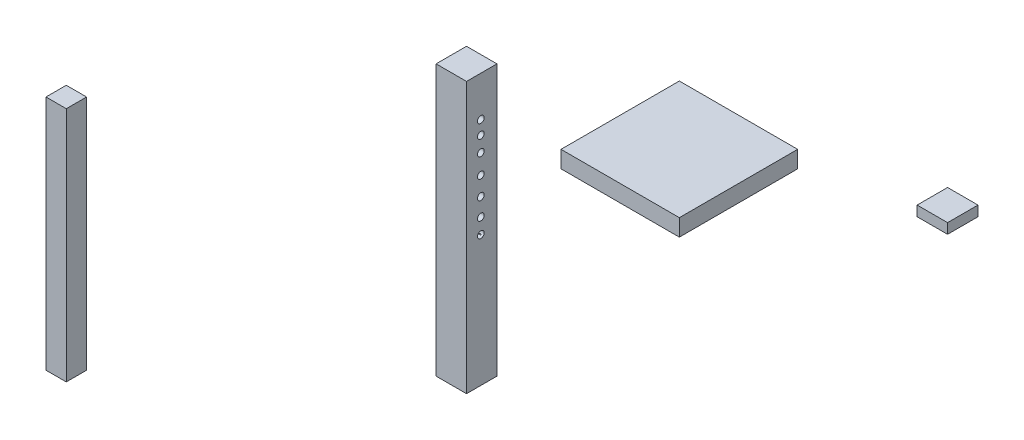
ISO-10303-21;
HEADER;
FILE_DESCRIPTION(('STEP AP214'),'2;1');
FILE_NAME('part.step','',(''),(''),'','','');
FILE_SCHEMA(('AUTOMOTIVE_DESIGN { 1 0 10303 214 1 1 1 1 }'));
ENDSEC;
DATA;
#1=APPLICATION_CONTEXT('core data for automotive mechanical design processes');
#2=APPLICATION_PROTOCOL_DEFINITION('international standard','automotive_design',2000,#1);
#3=PRODUCT_CONTEXT('',#1,'mechanical');
#4=PRODUCT('Part','Part','',(#3));
#5=PRODUCT_RELATED_PRODUCT_CATEGORY('part','',(#4));
#6=PRODUCT_DEFINITION_FORMATION('','',#4);
#7=PRODUCT_DEFINITION_CONTEXT('part definition',#1,'design');
#8=PRODUCT_DEFINITION('design','',#6,#7);
#9=PRODUCT_DEFINITION_SHAPE('','',#8);
#10=(LENGTH_UNIT() NAMED_UNIT(*) SI_UNIT(.MILLI.,.METRE.));
#11=(NAMED_UNIT(*) PLANE_ANGLE_UNIT() SI_UNIT($,.RADIAN.));
#12=(NAMED_UNIT(*) SI_UNIT($,.STERADIAN.) SOLID_ANGLE_UNIT());
#13=UNCERTAINTY_MEASURE_WITH_UNIT(LENGTH_MEASURE(1.E-05),#10,'distance_accuracy_value','');
#14=(GEOMETRIC_REPRESENTATION_CONTEXT(3) GLOBAL_UNCERTAINTY_ASSIGNED_CONTEXT((#13)) GLOBAL_UNIT_ASSIGNED_CONTEXT((#10,
#11,#12)) REPRESENTATION_CONTEXT('',''));
#15=CARTESIAN_POINT('',(0.,0.,0.));
#16=DIRECTION('',(0.,0.,1.));
#17=DIRECTION('',(1.,0.,0.));
#18=AXIS2_PLACEMENT_3D('',#15,#16,#17);
#19=CARTESIAN_POINT('',(-1105.99756095615,-800.,334.608602031665));
#20=DIRECTION('',(-1.,0.,0.));
#21=DIRECTION('',(0.,0.,1.));
#22=AXIS2_PLACEMENT_3D('',#19,#20,#21);
#23=PLANE('',#22);
#24=CARTESIAN_POINT('',(-1105.99756095615,-118.793047125797,292.265656849586));
#25=DIRECTION('',(-1.,0.,0.));
#26=DIRECTION('',(0.,0.,1.));
#27=AXIS2_PLACEMENT_3D('',#24,#25,#26);
#28=CIRCLE('',#27,9.99999999999998);
#29=CARTESIAN_POINT('',(-1105.99756095615,-118.793047125797,302.265656849586));
#30=VERTEX_POINT('',#29);
#31=EDGE_CURVE('E59',#30,#30,#28,.T.);
#32=ORIENTED_EDGE('',*,*,#31,.F.);
#33=EDGE_LOOP('',(#32));
#34=FACE_BOUND('',#33,.T.);
#35=CARTESIAN_POINT('',(-1105.99756095615,-203.734404492547,292.265656849586));
#36=DIRECTION('',(-1.,0.,0.));
#37=DIRECTION('',(0.,0.,1.));
#38=AXIS2_PLACEMENT_3D('',#35,#36,#37);
#39=CIRCLE('',#38,9.99999999999998);
#40=CARTESIAN_POINT('',(-1105.99756095615,-203.734404492547,302.265656849586));
#41=VERTEX_POINT('',#40);
#42=EDGE_CURVE('E143',#41,#41,#39,.T.);
#43=ORIENTED_EDGE('',*,*,#42,.F.);
#44=EDGE_LOOP('',(#43));
#45=FACE_BOUND('',#44,.T.);
#46=CARTESIAN_POINT('',(-1105.99756095615,-158.765450592503,292.265656849586));
#47=DIRECTION('',(-1.,0.,0.));
#48=DIRECTION('',(0.,0.,1.));
#49=AXIS2_PLACEMENT_3D('',#46,#47,#48);
#50=CIRCLE('',#49,9.99999999999998);
#51=CARTESIAN_POINT('',(-1105.99756095615,-158.765450592503,302.265656849586));
#52=VERTEX_POINT('',#51);
#53=EDGE_CURVE('E148',#52,#52,#50,.T.);
#54=ORIENTED_EDGE('',*,*,#53,.F.);
#55=EDGE_LOOP('',(#54));
#56=FACE_BOUND('',#55,.T.);
#57=CARTESIAN_POINT('',(-1105.99756095615,-261.194734475937,292.265656849586));
#58=DIRECTION('',(-1.,0.,0.));
#59=DIRECTION('',(0.,0.,1.));
#60=AXIS2_PLACEMENT_3D('',#57,#58,#59);
#61=CIRCLE('',#60,9.99999999999998);
#62=CARTESIAN_POINT('',(-1105.99756095615,-261.194734475937,302.265656849586));
#63=VERTEX_POINT('',#62);
#64=EDGE_CURVE('E153',#63,#63,#61,.T.);
#65=ORIENTED_EDGE('',*,*,#64,.F.);
#66=EDGE_LOOP('',(#65));
#67=FACE_BOUND('',#66,.T.);
#68=CARTESIAN_POINT('',(-1105.99756095615,-316.156789242658,292.265656849586));
#69=DIRECTION('',(-1.,0.,0.));
#70=DIRECTION('',(0.,0.,1.));
#71=AXIS2_PLACEMENT_3D('',#68,#69,#70);
#72=CIRCLE('',#71,9.99999999999998);
#73=CARTESIAN_POINT('',(-1105.99756095615,-316.156789242658,302.265656849586));
#74=VERTEX_POINT('',#73);
#75=EDGE_CURVE('E158',#74,#74,#72,.T.);
#76=ORIENTED_EDGE('',*,*,#75,.F.);
#77=EDGE_LOOP('',(#76));
#78=FACE_BOUND('',#77,.T.);
#79=CARTESIAN_POINT('',(-1105.99756095615,-368.62056879271,292.265656849586));
#80=DIRECTION('',(-1.,0.,0.));
#81=DIRECTION('',(0.,0.,1.));
#82=AXIS2_PLACEMENT_3D('',#79,#80,#81);
#83=CIRCLE('',#82,9.99999999999998);
#84=CARTESIAN_POINT('',(-1105.99756095615,-368.62056879271,302.265656849586));
#85=VERTEX_POINT('',#84);
#86=EDGE_CURVE('E163',#85,#85,#83,.T.);
#87=ORIENTED_EDGE('',*,*,#86,.F.);
#88=EDGE_LOOP('',(#87));
#89=FACE_BOUND('',#88,.T.);
#90=CARTESIAN_POINT('',(-1105.99756095615,-413.589522692754,292.265656849586));
#91=DIRECTION('',(-1.,0.,0.));
#92=DIRECTION('',(0.,0.,1.));
#93=AXIS2_PLACEMENT_3D('',#90,#91,#92);
#94=CIRCLE('',#93,9.99999999999998);
#95=CARTESIAN_POINT('',(-1105.99756095615,-413.589522692754,302.265656849586));
#96=VERTEX_POINT('',#95);
#97=EDGE_CURVE('E116',#96,#96,#94,.T.);
#98=ORIENTED_EDGE('',*,*,#97,.F.);
#99=EDGE_LOOP('',(#98));
#100=FACE_BOUND('',#99,.T.);
#101=DIRECTION('',(0.,0.,1.));
#102=VECTOR('',#101,1.);
#103=CARTESIAN_POINT('',(-1105.99756095615,0.,334.608602031665));
#104=LINE('',#103,#102);
#105=CARTESIAN_POINT('',(-1105.99756095615,0.,244.608602031665));
#106=VERTEX_POINT('',#105);
#107=CARTESIAN_POINT('',(-1105.99756095615,0.,334.608602031665));
#108=VERTEX_POINT('',#107);
#109=EDGE_CURVE('E105',#106,#108,#104,.T.);
#110=ORIENTED_EDGE('',*,*,#109,.F.);
#111=DIRECTION('',(0.,1.,0.));
#112=VECTOR('',#111,1.);
#113=CARTESIAN_POINT('',(-1105.99756095615,-800.,244.608602031665));
#114=LINE('',#113,#112);
#115=CARTESIAN_POINT('',(-1105.99756095615,-800.,244.608602031665));
#116=VERTEX_POINT('',#115);
#117=EDGE_CURVE('E91',#116,#106,#114,.T.);
#118=ORIENTED_EDGE('',*,*,#117,.F.);
#119=DIRECTION('',(0.,0.,1.));
#120=VECTOR('',#119,1.);
#121=CARTESIAN_POINT('',(-1105.99756095615,-800.,334.608602031665));
#122=LINE('',#121,#120);
#123=CARTESIAN_POINT('',(-1105.99756095615,-800.,334.608602031665));
#124=VERTEX_POINT('',#123);
#125=EDGE_CURVE('E136',#116,#124,#122,.T.);
#126=ORIENTED_EDGE('',*,*,#125,.T.);
#127=DIRECTION('',(0.,1.,0.));
#128=VECTOR('',#127,1.);
#129=CARTESIAN_POINT('',(-1105.99756095615,-800.,334.608602031665));
#130=LINE('',#129,#128);
#131=EDGE_CURVE('E106',#124,#108,#130,.T.);
#132=ORIENTED_EDGE('',*,*,#131,.T.);
#133=EDGE_LOOP('',(#110,#118,#126,#132));
#134=FACE_BOUND('',#133,.T.);
#135=ADVANCED_FACE('F50',(#34,#45,#56,#67,#78,#89,#100,#134),#23,.T.);
#136=CARTESIAN_POINT('',(-1105.99756095615,-800.,244.608602031665));
#137=DIRECTION('',(0.,0.,-1.));
#138=DIRECTION('',(-1.,0.,0.));
#139=AXIS2_PLACEMENT_3D('',#136,#137,#138);
#140=PLANE('',#139);
#141=DIRECTION('',(-1.,0.,0.));
#142=VECTOR('',#141,1.);
#143=CARTESIAN_POINT('',(-1105.99756095615,0.,244.608602031665));
#144=LINE('',#143,#142);
#145=CARTESIAN_POINT('',(-1015.99756095615,0.,244.608602031665));
#146=VERTEX_POINT('',#145);
#147=EDGE_CURVE('E95',#146,#106,#144,.T.);
#148=ORIENTED_EDGE('',*,*,#147,.F.);
#149=DIRECTION('',(0.,1.,0.));
#150=VECTOR('',#149,1.);
#151=CARTESIAN_POINT('',(-1015.99756095615,-800.,244.608602031665));
#152=LINE('',#151,#150);
#153=CARTESIAN_POINT('',(-1015.99756095615,-800.,244.608602031665));
#154=VERTEX_POINT('',#153);
#155=EDGE_CURVE('E132',#154,#146,#152,.T.);
#156=ORIENTED_EDGE('',*,*,#155,.F.);
#157=DIRECTION('',(-1.,0.,0.));
#158=VECTOR('',#157,1.);
#159=CARTESIAN_POINT('',(-1105.99756095615,-800.,244.608602031665));
#160=LINE('',#159,#158);
#161=EDGE_CURVE('E97',#154,#116,#160,.T.);
#162=ORIENTED_EDGE('',*,*,#161,.T.);
#163=ORIENTED_EDGE('',*,*,#117,.T.);
#164=EDGE_LOOP('',(#148,#156,#162,#163));
#165=FACE_BOUND('',#164,.T.);
#166=ADVANCED_FACE('F93',(#165),#140,.T.);
#167=CARTESIAN_POINT('',(-1015.99756095615,-800.,334.608602031665));
#168=DIRECTION('',(1.,0.,0.));
#169=DIRECTION('',(0.,0.,-1.));
#170=AXIS2_PLACEMENT_3D('',#167,#168,#169);
#171=PLANE('',#170);
#172=CARTESIAN_POINT('',(-1015.99756095615,-118.793047125797,292.265656849586));
#173=DIRECTION('',(1.,0.,0.));
#174=DIRECTION('',(0.,0.,-1.));
#175=AXIS2_PLACEMENT_3D('',#172,#173,#174);
#176=CIRCLE('',#175,9.99999999999998);
#177=CARTESIAN_POINT('',(-1015.99756095615,-118.793047125797,282.265656849586));
#178=VERTEX_POINT('',#177);
#179=EDGE_CURVE('E12',#178,#178,#176,.T.);
#180=ORIENTED_EDGE('',*,*,#179,.F.);
#181=EDGE_LOOP('',(#180));
#182=FACE_BOUND('',#181,.T.);
#183=CARTESIAN_POINT('',(-1015.99756095615,-203.734404492547,292.265656849586));
#184=DIRECTION('',(1.,0.,0.));
#185=DIRECTION('',(0.,0.,-1.));
#186=AXIS2_PLACEMENT_3D('',#183,#184,#185);
#187=CIRCLE('',#186,9.99999999999998);
#188=CARTESIAN_POINT('',(-1015.99756095615,-203.734404492547,282.265656849586));
#189=VERTEX_POINT('',#188);
#190=EDGE_CURVE('E142',#189,#189,#187,.T.);
#191=ORIENTED_EDGE('',*,*,#190,.F.);
#192=EDGE_LOOP('',(#191));
#193=FACE_BOUND('',#192,.T.);
#194=CARTESIAN_POINT('',(-1015.99756095615,-158.765450592503,292.265656849586));
#195=DIRECTION('',(1.,0.,0.));
#196=DIRECTION('',(0.,0.,-1.));
#197=AXIS2_PLACEMENT_3D('',#194,#195,#196);
#198=CIRCLE('',#197,9.99999999999998);
#199=CARTESIAN_POINT('',(-1015.99756095615,-158.765450592503,282.265656849586));
#200=VERTEX_POINT('',#199);
#201=EDGE_CURVE('E147',#200,#200,#198,.T.);
#202=ORIENTED_EDGE('',*,*,#201,.F.);
#203=EDGE_LOOP('',(#202));
#204=FACE_BOUND('',#203,.T.);
#205=CARTESIAN_POINT('',(-1015.99756095615,-261.194734475937,292.265656849586));
#206=DIRECTION('',(1.,0.,0.));
#207=DIRECTION('',(0.,0.,-1.));
#208=AXIS2_PLACEMENT_3D('',#205,#206,#207);
#209=CIRCLE('',#208,9.99999999999998);
#210=CARTESIAN_POINT('',(-1015.99756095615,-261.194734475937,282.265656849586));
#211=VERTEX_POINT('',#210);
#212=EDGE_CURVE('E152',#211,#211,#209,.T.);
#213=ORIENTED_EDGE('',*,*,#212,.F.);
#214=EDGE_LOOP('',(#213));
#215=FACE_BOUND('',#214,.T.);
#216=CARTESIAN_POINT('',(-1015.99756095615,-316.156789242658,292.265656849586));
#217=DIRECTION('',(1.,0.,0.));
#218=DIRECTION('',(0.,0.,-1.));
#219=AXIS2_PLACEMENT_3D('',#216,#217,#218);
#220=CIRCLE('',#219,9.99999999999998);
#221=CARTESIAN_POINT('',(-1015.99756095615,-316.156789242658,282.265656849586));
#222=VERTEX_POINT('',#221);
#223=EDGE_CURVE('E157',#222,#222,#220,.T.);
#224=ORIENTED_EDGE('',*,*,#223,.F.);
#225=EDGE_LOOP('',(#224));
#226=FACE_BOUND('',#225,.T.);
#227=CARTESIAN_POINT('',(-1015.99756095615,-368.62056879271,292.265656849586));
#228=DIRECTION('',(1.,0.,0.));
#229=DIRECTION('',(0.,0.,-1.));
#230=AXIS2_PLACEMENT_3D('',#227,#228,#229);
#231=CIRCLE('',#230,9.99999999999998);
#232=CARTESIAN_POINT('',(-1015.99756095615,-368.62056879271,282.265656849586));
#233=VERTEX_POINT('',#232);
#234=EDGE_CURVE('E162',#233,#233,#231,.T.);
#235=ORIENTED_EDGE('',*,*,#234,.F.);
#236=EDGE_LOOP('',(#235));
#237=FACE_BOUND('',#236,.T.);
#238=CARTESIAN_POINT('',(-1015.99756095615,-413.589522692754,292.265656849586));
#239=DIRECTION('',(1.,0.,0.));
#240=DIRECTION('',(0.,0.,-1.));
#241=AXIS2_PLACEMENT_3D('',#238,#239,#240);
#242=CIRCLE('',#241,9.99999999999998);
#243=CARTESIAN_POINT('',(-1015.99756095615,-413.589522692754,282.265656849586));
#244=VERTEX_POINT('',#243);
#245=EDGE_CURVE('E121',#244,#244,#242,.T.);
#246=ORIENTED_EDGE('',*,*,#245,.F.);
#247=EDGE_LOOP('',(#246));
#248=FACE_BOUND('',#247,.T.);
#249=DIRECTION('',(0.,0.,-1.));
#250=VECTOR('',#249,1.);
#251=CARTESIAN_POINT('',(-1015.99756095615,0.,334.608602031665));
#252=LINE('',#251,#250);
#253=CARTESIAN_POINT('',(-1015.99756095615,0.,334.608602031665));
#254=VERTEX_POINT('',#253);
#255=EDGE_CURVE('E114',#254,#146,#252,.T.);
#256=ORIENTED_EDGE('',*,*,#255,.F.);
#257=DIRECTION('',(0.,1.,0.));
#258=VECTOR('',#257,1.);
#259=CARTESIAN_POINT('',(-1015.99756095615,-800.,334.608602031665));
#260=LINE('',#259,#258);
#261=CARTESIAN_POINT('',(-1015.99756095615,-800.,334.608602031665));
#262=VERTEX_POINT('',#261);
#263=EDGE_CURVE('E66',#262,#254,#260,.T.);
#264=ORIENTED_EDGE('',*,*,#263,.F.);
#265=DIRECTION('',(0.,0.,-1.));
#266=VECTOR('',#265,1.);
#267=CARTESIAN_POINT('',(-1015.99756095615,-800.,334.608602031665));
#268=LINE('',#267,#266);
#269=EDGE_CURVE('E102',#262,#154,#268,.T.);
#270=ORIENTED_EDGE('',*,*,#269,.T.);
#271=ORIENTED_EDGE('',*,*,#155,.T.);
#272=EDGE_LOOP('',(#256,#264,#270,#271));
#273=FACE_BOUND('',#272,.T.);
#274=ADVANCED_FACE('F187',(#182,#193,#204,#215,#226,#237,#248,#273),#171,.T.);
#275=CARTESIAN_POINT('',(-1105.99756095615,-800.,334.608602031665));
#276=DIRECTION('',(0.,0.,1.));
#277=DIRECTION('',(1.,0.,0.));
#278=AXIS2_PLACEMENT_3D('',#275,#276,#277);
#279=PLANE('',#278);
#280=DIRECTION('',(1.,0.,0.));
#281=VECTOR('',#280,1.);
#282=CARTESIAN_POINT('',(-1105.99756095615,0.,334.608602031665));
#283=LINE('',#282,#281);
#284=EDGE_CURVE('E110',#108,#254,#283,.T.);
#285=ORIENTED_EDGE('',*,*,#284,.F.);
#286=ORIENTED_EDGE('',*,*,#131,.F.);
#287=DIRECTION('',(1.,0.,0.));
#288=VECTOR('',#287,1.);
#289=CARTESIAN_POINT('',(-1105.99756095615,-800.,334.608602031665));
#290=LINE('',#289,#288);
#291=EDGE_CURVE('E133',#124,#262,#290,.T.);
#292=ORIENTED_EDGE('',*,*,#291,.T.);
#293=ORIENTED_EDGE('',*,*,#263,.T.);
#294=EDGE_LOOP('',(#285,#286,#292,#293));
#295=FACE_BOUND('',#294,.T.);
#296=ADVANCED_FACE('F190',(#295),#279,.T.);
#297=CARTESIAN_POINT('',(0.,-800.,0.));
#298=DIRECTION('',(0.,-1.,0.));
#299=DIRECTION('',(0.,0.,-1.));
#300=AXIS2_PLACEMENT_3D('',#297,#298,#299);
#301=PLANE('',#300);
#302=ORIENTED_EDGE('',*,*,#125,.F.);
#303=ORIENTED_EDGE('',*,*,#161,.F.);
#304=ORIENTED_EDGE('',*,*,#269,.F.);
#305=ORIENTED_EDGE('',*,*,#291,.F.);
#306=EDGE_LOOP('',(#302,#303,#304,#305));
#307=FACE_BOUND('',#306,.T.);
#308=ADVANCED_FACE('F205',(#307),#301,.T.);
#309=CARTESIAN_POINT('',(0.,0.,0.));
#310=DIRECTION('',(0.,-1.,0.));
#311=DIRECTION('',(0.,0.,-1.));
#312=AXIS2_PLACEMENT_3D('',#309,#310,#311);
#313=PLANE('',#312);
#314=ORIENTED_EDGE('',*,*,#109,.T.);
#315=ORIENTED_EDGE('',*,*,#284,.T.);
#316=ORIENTED_EDGE('',*,*,#255,.T.);
#317=ORIENTED_EDGE('',*,*,#147,.T.);
#318=EDGE_LOOP('',(#314,#315,#316,#317));
#319=FACE_BOUND('',#318,.T.);
#320=ADVANCED_FACE('F113',(#319),#313,.F.);
#321=CARTESIAN_POINT('',(-1598.05558261917,-413.589522692754,292.265656849586));
#322=DIRECTION('',(1.,0.,0.));
#323=DIRECTION('',(0.,0.,-1.));
#324=AXIS2_PLACEMENT_3D('',#321,#322,#323);
#325=CYLINDRICAL_SURFACE('',#324,9.99999999999998);
#326=ORIENTED_EDGE('',*,*,#97,.T.);
#327=EDGE_LOOP('',(#326));
#328=FACE_BOUND('',#327,.T.);
#329=ORIENTED_EDGE('',*,*,#245,.T.);
#330=EDGE_LOOP('',(#329));
#331=FACE_BOUND('',#330,.T.);
#332=ADVANCED_FACE('F212',(#328,#331),#325,.F.);
#333=CARTESIAN_POINT('',(-1598.05558261917,-368.62056879271,292.265656849586));
#334=DIRECTION('',(1.,0.,0.));
#335=DIRECTION('',(0.,0.,-1.));
#336=AXIS2_PLACEMENT_3D('',#333,#334,#335);
#337=CYLINDRICAL_SURFACE('',#336,9.99999999999998);
#338=ORIENTED_EDGE('',*,*,#86,.T.);
#339=EDGE_LOOP('',(#338));
#340=FACE_BOUND('',#339,.T.);
#341=ORIENTED_EDGE('',*,*,#234,.T.);
#342=EDGE_LOOP('',(#341));
#343=FACE_BOUND('',#342,.T.);
#344=ADVANCED_FACE('F238',(#340,#343),#337,.F.);
#345=CARTESIAN_POINT('',(-1598.05558261917,-316.156789242658,292.265656849586));
#346=DIRECTION('',(1.,0.,0.));
#347=DIRECTION('',(0.,0.,-1.));
#348=AXIS2_PLACEMENT_3D('',#345,#346,#347);
#349=CYLINDRICAL_SURFACE('',#348,9.99999999999998);
#350=ORIENTED_EDGE('',*,*,#75,.T.);
#351=EDGE_LOOP('',(#350));
#352=FACE_BOUND('',#351,.T.);
#353=ORIENTED_EDGE('',*,*,#223,.T.);
#354=EDGE_LOOP('',(#353));
#355=FACE_BOUND('',#354,.T.);
#356=ADVANCED_FACE('F242',(#352,#355),#349,.F.);
#357=CARTESIAN_POINT('',(-1598.05558261917,-261.194734475937,292.265656849586));
#358=DIRECTION('',(1.,0.,0.));
#359=DIRECTION('',(0.,0.,-1.));
#360=AXIS2_PLACEMENT_3D('',#357,#358,#359);
#361=CYLINDRICAL_SURFACE('',#360,9.99999999999998);
#362=ORIENTED_EDGE('',*,*,#64,.T.);
#363=EDGE_LOOP('',(#362));
#364=FACE_BOUND('',#363,.T.);
#365=ORIENTED_EDGE('',*,*,#212,.T.);
#366=EDGE_LOOP('',(#365));
#367=FACE_BOUND('',#366,.T.);
#368=ADVANCED_FACE('F248',(#364,#367),#361,.F.);
#369=CARTESIAN_POINT('',(-1598.05558261917,-158.765450592503,292.265656849586));
#370=DIRECTION('',(1.,0.,0.));
#371=DIRECTION('',(0.,0.,-1.));
#372=AXIS2_PLACEMENT_3D('',#369,#370,#371);
#373=CYLINDRICAL_SURFACE('',#372,9.99999999999998);
#374=ORIENTED_EDGE('',*,*,#53,.T.);
#375=EDGE_LOOP('',(#374));
#376=FACE_BOUND('',#375,.T.);
#377=ORIENTED_EDGE('',*,*,#201,.T.);
#378=EDGE_LOOP('',(#377));
#379=FACE_BOUND('',#378,.T.);
#380=ADVANCED_FACE('F252',(#376,#379),#373,.F.);
#381=CARTESIAN_POINT('',(-1598.05558261917,-203.734404492547,292.265656849586));
#382=DIRECTION('',(1.,0.,0.));
#383=DIRECTION('',(0.,0.,-1.));
#384=AXIS2_PLACEMENT_3D('',#381,#382,#383);
#385=CYLINDRICAL_SURFACE('',#384,9.99999999999998);
#386=ORIENTED_EDGE('',*,*,#42,.T.);
#387=EDGE_LOOP('',(#386));
#388=FACE_BOUND('',#387,.T.);
#389=ORIENTED_EDGE('',*,*,#190,.T.);
#390=EDGE_LOOP('',(#389));
#391=FACE_BOUND('',#390,.T.);
#392=ADVANCED_FACE('F185',(#388,#391),#385,.F.);
#393=CARTESIAN_POINT('',(-1598.05558261917,-118.793047125797,292.265656849586));
#394=DIRECTION('',(1.,0.,0.));
#395=DIRECTION('',(0.,0.,-1.));
#396=AXIS2_PLACEMENT_3D('',#393,#394,#395);
#397=CYLINDRICAL_SURFACE('',#396,9.99999999999998);
#398=ORIENTED_EDGE('',*,*,#31,.T.);
#399=EDGE_LOOP('',(#398));
#400=FACE_BOUND('',#399,.T.);
#401=ORIENTED_EDGE('',*,*,#179,.T.);
#402=EDGE_LOOP('',(#401));
#403=FACE_BOUND('',#402,.T.);
#404=ADVANCED_FACE('F259',(#400,#403),#397,.F.);
#405=CLOSED_SHELL('',(#135,#166,#274,#296,#308,#320,#332,#344,#356,#368,#380,#392,#404));
#406=MANIFOLD_SOLID_BREP('B2',#405);
#407=CARTESIAN_POINT('',(-1598.05558261917,-700.,996.375876906711));
#408=DIRECTION('',(-1.,0.,0.));
#409=DIRECTION('',(0.,0.,1.));
#410=AXIS2_PLACEMENT_3D('',#407,#408,#409);
#411=PLANE('',#410);
#412=DIRECTION('',(0.,0.,1.));
#413=VECTOR('',#412,1.);
#414=CARTESIAN_POINT('',(-1598.05558261917,0.,996.375876906711));
#415=LINE('',#414,#413);
#416=CARTESIAN_POINT('',(-1598.05558261917,0.,936.375876906711));
#417=VERTEX_POINT('',#416);
#418=CARTESIAN_POINT('',(-1598.05558261917,0.,996.375876906711));
#419=VERTEX_POINT('',#418);
#420=EDGE_CURVE('E419',#417,#419,#415,.T.);
#421=ORIENTED_EDGE('',*,*,#420,.F.);
#422=DIRECTION('',(0.,1.,0.));
#423=VECTOR('',#422,1.);
#424=CARTESIAN_POINT('',(-1598.05558261917,-700.,936.375876906711));
#425=LINE('',#424,#423);
#426=CARTESIAN_POINT('',(-1598.05558261917,-700.,936.375876906711));
#427=VERTEX_POINT('',#426);
#428=EDGE_CURVE('E48',#427,#417,#425,.T.);
#429=ORIENTED_EDGE('',*,*,#428,.F.);
#430=DIRECTION('',(0.,0.,1.));
#431=VECTOR('',#430,1.);
#432=CARTESIAN_POINT('',(-1598.05558261917,-700.,996.375876906711));
#433=LINE('',#432,#431);
#434=CARTESIAN_POINT('',(-1598.05558261917,-700.,996.375876906711));
#435=VERTEX_POINT('',#434);
#436=EDGE_CURVE('E413',#427,#435,#433,.T.);
#437=ORIENTED_EDGE('',*,*,#436,.T.);
#438=DIRECTION('',(0.,1.,0.));
#439=VECTOR('',#438,1.);
#440=CARTESIAN_POINT('',(-1598.05558261917,-700.,996.375876906711));
#441=LINE('',#440,#439);
#442=EDGE_CURVE('E358',#435,#419,#441,.T.);
#443=ORIENTED_EDGE('',*,*,#442,.T.);
#444=EDGE_LOOP('',(#421,#429,#437,#443));
#445=FACE_BOUND('',#444,.T.);
#446=ADVANCED_FACE('F355',(#445),#411,.T.);
#447=CARTESIAN_POINT('',(-1598.05558261917,-700.,936.375876906711));
#448=DIRECTION('',(0.,0.,-1.));
#449=DIRECTION('',(-1.,0.,0.));
#450=AXIS2_PLACEMENT_3D('',#447,#448,#449);
#451=PLANE('',#450);
#452=DIRECTION('',(-1.,0.,0.));
#453=VECTOR('',#452,1.);
#454=CARTESIAN_POINT('',(-1598.05558261917,0.,936.375876906711));
#455=LINE('',#454,#453);
#456=CARTESIAN_POINT('',(-1538.05558261917,0.,936.375876906711));
#457=VERTEX_POINT('',#456);
#458=EDGE_CURVE('E415',#457,#417,#455,.T.);
#459=ORIENTED_EDGE('',*,*,#458,.F.);
#460=DIRECTION('',(0.,1.,0.));
#461=VECTOR('',#460,1.);
#462=CARTESIAN_POINT('',(-1538.05558261917,-700.,936.375876906711));
#463=LINE('',#462,#461);
#464=CARTESIAN_POINT('',(-1538.05558261917,-700.,936.375876906711));
#465=VERTEX_POINT('',#464);
#466=EDGE_CURVE('E364',#465,#457,#463,.T.);
#467=ORIENTED_EDGE('',*,*,#466,.F.);
#468=DIRECTION('',(-1.,0.,0.));
#469=VECTOR('',#468,1.);
#470=CARTESIAN_POINT('',(-1598.05558261917,-700.,936.375876906711));
#471=LINE('',#470,#469);
#472=EDGE_CURVE('E410',#465,#427,#471,.T.);
#473=ORIENTED_EDGE('',*,*,#472,.T.);
#474=ORIENTED_EDGE('',*,*,#428,.T.);
#475=EDGE_LOOP('',(#459,#467,#473,#474));
#476=FACE_BOUND('',#475,.T.);
#477=ADVANCED_FACE('F429',(#476),#451,.T.);
#478=CARTESIAN_POINT('',(-1538.05558261917,-700.,996.375876906711));
#479=DIRECTION('',(1.,0.,0.));
#480=DIRECTION('',(0.,0.,-1.));
#481=AXIS2_PLACEMENT_3D('',#478,#479,#480);
#482=PLANE('',#481);
#483=DIRECTION('',(0.,0.,-1.));
#484=VECTOR('',#483,1.);
#485=CARTESIAN_POINT('',(-1538.05558261917,0.,996.375876906711));
#486=LINE('',#485,#484);
#487=CARTESIAN_POINT('',(-1538.05558261917,0.,996.375876906711));
#488=VERTEX_POINT('',#487);
#489=EDGE_CURVE('E405',#488,#457,#486,.T.);
#490=ORIENTED_EDGE('',*,*,#489,.F.);
#491=DIRECTION('',(0.,1.,0.));
#492=VECTOR('',#491,1.);
#493=CARTESIAN_POINT('',(-1538.05558261917,-700.,996.375876906711));
#494=LINE('',#493,#492);
#495=CARTESIAN_POINT('',(-1538.05558261917,-700.,996.375876906711));
#496=VERTEX_POINT('',#495);
#497=EDGE_CURVE('E400',#496,#488,#494,.T.);
#498=ORIENTED_EDGE('',*,*,#497,.F.);
#499=DIRECTION('',(0.,0.,-1.));
#500=VECTOR('',#499,1.);
#501=CARTESIAN_POINT('',(-1538.05558261917,-700.,996.375876906711));
#502=LINE('',#501,#500);
#503=EDGE_CURVE('E403',#496,#465,#502,.T.);
#504=ORIENTED_EDGE('',*,*,#503,.T.);
#505=ORIENTED_EDGE('',*,*,#466,.T.);
#506=EDGE_LOOP('',(#490,#498,#504,#505));
#507=FACE_BOUND('',#506,.T.);
#508=ADVANCED_FACE('F402',(#507),#482,.T.);
#509=CARTESIAN_POINT('',(-1598.05558261917,-700.,996.375876906711));
#510=DIRECTION('',(0.,0.,1.));
#511=DIRECTION('',(1.,0.,0.));
#512=AXIS2_PLACEMENT_3D('',#509,#510,#511);
#513=PLANE('',#512);
#514=DIRECTION('',(1.,0.,0.));
#515=VECTOR('',#514,1.);
#516=CARTESIAN_POINT('',(-1598.05558261917,0.,996.375876906711));
#517=LINE('',#516,#515);
#518=EDGE_CURVE('E422',#419,#488,#517,.T.);
#519=ORIENTED_EDGE('',*,*,#518,.F.);
#520=ORIENTED_EDGE('',*,*,#442,.F.);
#521=DIRECTION('',(1.,0.,0.));
#522=VECTOR('',#521,1.);
#523=CARTESIAN_POINT('',(-1598.05558261917,-700.,996.375876906711));
#524=LINE('',#523,#522);
#525=EDGE_CURVE('E409',#435,#496,#524,.T.);
#526=ORIENTED_EDGE('',*,*,#525,.T.);
#527=ORIENTED_EDGE('',*,*,#497,.T.);
#528=EDGE_LOOP('',(#519,#520,#526,#527));
#529=FACE_BOUND('',#528,.T.);
#530=ADVANCED_FACE('F412',(#529),#513,.T.);
#531=CARTESIAN_POINT('',(0.,-700.,0.));
#532=DIRECTION('',(0.,-1.,0.));
#533=DIRECTION('',(0.,0.,-1.));
#534=AXIS2_PLACEMENT_3D('',#531,#532,#533);
#535=PLANE('',#534);
#536=ORIENTED_EDGE('',*,*,#436,.F.);
#537=ORIENTED_EDGE('',*,*,#472,.F.);
#538=ORIENTED_EDGE('',*,*,#503,.F.);
#539=ORIENTED_EDGE('',*,*,#525,.F.);
#540=EDGE_LOOP('',(#536,#537,#538,#539));
#541=FACE_BOUND('',#540,.T.);
#542=ADVANCED_FACE('F408',(#541),#535,.T.);
#543=CARTESIAN_POINT('',(0.,0.,0.));
#544=DIRECTION('',(0.,-1.,0.));
#545=DIRECTION('',(0.,0.,-1.));
#546=AXIS2_PLACEMENT_3D('',#543,#544,#545);
#547=PLANE('',#546);
#548=ORIENTED_EDGE('',*,*,#420,.T.);
#549=ORIENTED_EDGE('',*,*,#518,.T.);
#550=ORIENTED_EDGE('',*,*,#489,.T.);
#551=ORIENTED_EDGE('',*,*,#458,.T.);
#552=EDGE_LOOP('',(#548,#549,#550,#551));
#553=FACE_BOUND('',#552,.T.);
#554=ADVANCED_FACE('F428',(#553),#547,.F.);
#555=CLOSED_SHELL('',(#446,#477,#508,#530,#542,#554));
#556=MANIFOLD_SOLID_BREP('B6',#555);
#557=CARTESIAN_POINT('',(-1015.99756095615,-800.,334.608602031665));
#558=DIRECTION('',(1.,0.,0.));
#559=DIRECTION('',(0.,0.,-1.));
#560=AXIS2_PLACEMENT_3D('',#557,#558,#559);
#561=PLANE('',#560);
#562=CARTESIAN_POINT('',(-1015.99756095615,-413.589522692754,292.265656849586));
#563=DIRECTION('',(1.,0.,0.));
#564=DIRECTION('',(0.,0.,-1.));
#565=AXIS2_PLACEMENT_3D('',#562,#563,#564);
#566=CIRCLE('',#565,0.999999999999998);
#567=CARTESIAN_POINT('',(-1015.99756095615,-413.589522692754,291.265656849586));
#568=VERTEX_POINT('',#567);
#569=EDGE_CURVE('E496',#568,#568,#566,.T.);
#570=ORIENTED_EDGE('',*,*,#569,.T.);
#571=EDGE_LOOP('',(#570));
#572=FACE_BOUND('',#571,.T.);
#573=ADVANCED_FACE('F489',(#572),#561,.T.);
#574=CARTESIAN_POINT('',(-1598.05558261917,-413.589522692754,292.265656849586));
#575=DIRECTION('',(1.,0.,0.));
#576=DIRECTION('',(0.,0.,-1.));
#577=AXIS2_PLACEMENT_3D('',#574,#575,#576);
#578=CYLINDRICAL_SURFACE('',#577,0.999999999999998);
#579=CARTESIAN_POINT('',(-1105.99756095615,-413.589522692754,292.265656849586));
#580=DIRECTION('',(-1.,0.,0.));
#581=DIRECTION('',(0.,0.,1.));
#582=AXIS2_PLACEMENT_3D('',#579,#580,#581);
#583=CIRCLE('',#582,0.999999999999998);
#584=CARTESIAN_POINT('',(-1105.99756095615,-413.589522692754,293.265656849586));
#585=VERTEX_POINT('',#584);
#586=EDGE_CURVE('E354',#585,#585,#583,.T.);
#587=ORIENTED_EDGE('',*,*,#586,.F.);
#588=EDGE_LOOP('',(#587));
#589=FACE_BOUND('',#588,.T.);
#590=ORIENTED_EDGE('',*,*,#569,.F.);
#591=EDGE_LOOP('',(#590));
#592=FACE_BOUND('',#591,.T.);
#593=ADVANCED_FACE('F503',(#589,#592),#578,.T.);
#594=CARTESIAN_POINT('',(-1105.99756095615,-800.,334.608602031665));
#595=DIRECTION('',(-1.,0.,0.));
#596=DIRECTION('',(0.,0.,1.));
#597=AXIS2_PLACEMENT_3D('',#594,#595,#596);
#598=PLANE('',#597);
#599=ORIENTED_EDGE('',*,*,#586,.T.);
#600=EDGE_LOOP('',(#599));
#601=FACE_BOUND('',#600,.T.);
#602=ADVANCED_FACE('F491',(#601),#598,.T.);
#603=CLOSED_SHELL('',(#573,#593,#602));
#604=MANIFOLD_SOLID_BREP('B42',#603);
#605=CARTESIAN_POINT('',(-702.284369239408,-50.,368.819852956904));
#606=DIRECTION('',(-1.,0.,0.));
#607=DIRECTION('',(0.,0.,1.));
#608=AXIS2_PLACEMENT_3D('',#605,#606,#607);
#609=PLANE('',#608);
#610=DIRECTION('',(0.,0.,1.));
#611=VECTOR('',#610,1.);
#612=CARTESIAN_POINT('',(-702.284369239408,0.,368.819852956904));
#613=LINE('',#612,#611);
#614=CARTESIAN_POINT('',(-702.284369239408,0.,18.8198529569036));
#615=VERTEX_POINT('',#614);
#616=CARTESIAN_POINT('',(-702.284369239408,0.,368.819852956904));
#617=VERTEX_POINT('',#616);
#618=EDGE_CURVE('E603',#615,#617,#613,.T.);
#619=ORIENTED_EDGE('',*,*,#618,.F.);
#620=DIRECTION('',(0.,1.,0.));
#621=VECTOR('',#620,1.);
#622=CARTESIAN_POINT('',(-702.284369239408,-50.,18.8198529569036));
#623=LINE('',#622,#621);
#624=CARTESIAN_POINT('',(-702.284369239408,-50.,18.8198529569036));
#625=VERTEX_POINT('',#624);
#626=EDGE_CURVE('E487',#625,#615,#623,.T.);
#627=ORIENTED_EDGE('',*,*,#626,.F.);
#628=DIRECTION('',(0.,0.,1.));
#629=VECTOR('',#628,1.);
#630=CARTESIAN_POINT('',(-702.284369239408,-50.,368.819852956904));
#631=LINE('',#630,#629);
#632=CARTESIAN_POINT('',(-702.284369239408,-50.,368.819852956904));
#633=VERTEX_POINT('',#632);
#634=EDGE_CURVE('E597',#625,#633,#631,.T.);
#635=ORIENTED_EDGE('',*,*,#634,.T.);
#636=DIRECTION('',(0.,1.,0.));
#637=VECTOR('',#636,1.);
#638=CARTESIAN_POINT('',(-702.284369239408,-50.,368.819852956904));
#639=LINE('',#638,#637);
#640=EDGE_CURVE('E542',#633,#617,#639,.T.);
#641=ORIENTED_EDGE('',*,*,#640,.T.);
#642=EDGE_LOOP('',(#619,#627,#635,#641));
#643=FACE_BOUND('',#642,.T.);
#644=ADVANCED_FACE('F539',(#643),#609,.T.);
#645=CARTESIAN_POINT('',(-702.284369239408,-50.,18.8198529569036));
#646=DIRECTION('',(0.,0.,-1.));
#647=DIRECTION('',(-1.,0.,0.));
#648=AXIS2_PLACEMENT_3D('',#645,#646,#647);
#649=PLANE('',#648);
#650=DIRECTION('',(-1.,0.,0.));
#651=VECTOR('',#650,1.);
#652=CARTESIAN_POINT('',(-702.284369239408,0.,18.8198529569036));
#653=LINE('',#652,#651);
#654=CARTESIAN_POINT('',(-352.284369239408,0.,18.8198529569036));
#655=VERTEX_POINT('',#654);
#656=EDGE_CURVE('E599',#655,#615,#653,.T.);
#657=ORIENTED_EDGE('',*,*,#656,.F.);
#658=DIRECTION('',(0.,1.,0.));
#659=VECTOR('',#658,1.);
#660=CARTESIAN_POINT('',(-352.284369239408,-50.,18.8198529569036));
#661=LINE('',#660,#659);
#662=CARTESIAN_POINT('',(-352.284369239408,-50.,18.8198529569036));
#663=VERTEX_POINT('',#662);
#664=EDGE_CURVE('E548',#663,#655,#661,.T.);
#665=ORIENTED_EDGE('',*,*,#664,.F.);
#666=DIRECTION('',(-1.,0.,0.));
#667=VECTOR('',#666,1.);
#668=CARTESIAN_POINT('',(-702.284369239408,-50.,18.8198529569036));
#669=LINE('',#668,#667);
#670=EDGE_CURVE('E594',#663,#625,#669,.T.);
#671=ORIENTED_EDGE('',*,*,#670,.T.);
#672=ORIENTED_EDGE('',*,*,#626,.T.);
#673=EDGE_LOOP('',(#657,#665,#671,#672));
#674=FACE_BOUND('',#673,.T.);
#675=ADVANCED_FACE('F613',(#674),#649,.T.);
#676=CARTESIAN_POINT('',(-352.284369239408,-50.,368.819852956904));
#677=DIRECTION('',(1.,0.,0.));
#678=DIRECTION('',(0.,0.,-1.));
#679=AXIS2_PLACEMENT_3D('',#676,#677,#678);
#680=PLANE('',#679);
#681=DIRECTION('',(0.,0.,-1.));
#682=VECTOR('',#681,1.);
#683=CARTESIAN_POINT('',(-352.284369239408,0.,368.819852956904));
#684=LINE('',#683,#682);
#685=CARTESIAN_POINT('',(-352.284369239408,0.,368.819852956904));
#686=VERTEX_POINT('',#685);
#687=EDGE_CURVE('E589',#686,#655,#684,.T.);
#688=ORIENTED_EDGE('',*,*,#687,.F.);
#689=DIRECTION('',(0.,1.,0.));
#690=VECTOR('',#689,1.);
#691=CARTESIAN_POINT('',(-352.284369239408,-50.,368.819852956904));
#692=LINE('',#691,#690);
#693=CARTESIAN_POINT('',(-352.284369239408,-50.,368.819852956904));
#694=VERTEX_POINT('',#693);
#695=EDGE_CURVE('E584',#694,#686,#692,.T.);
#696=ORIENTED_EDGE('',*,*,#695,.F.);
#697=DIRECTION('',(0.,0.,-1.));
#698=VECTOR('',#697,1.);
#699=CARTESIAN_POINT('',(-352.284369239408,-50.,368.819852956904));
#700=LINE('',#699,#698);
#701=EDGE_CURVE('E587',#694,#663,#700,.T.);
#702=ORIENTED_EDGE('',*,*,#701,.T.);
#703=ORIENTED_EDGE('',*,*,#664,.T.);
#704=EDGE_LOOP('',(#688,#696,#702,#703));
#705=FACE_BOUND('',#704,.T.);
#706=ADVANCED_FACE('F586',(#705),#680,.T.);
#707=CARTESIAN_POINT('',(-702.284369239408,-50.,368.819852956904));
#708=DIRECTION('',(0.,0.,1.));
#709=DIRECTION('',(1.,0.,0.));
#710=AXIS2_PLACEMENT_3D('',#707,#708,#709);
#711=PLANE('',#710);
#712=DIRECTION('',(1.,0.,0.));
#713=VECTOR('',#712,1.);
#714=CARTESIAN_POINT('',(-702.284369239408,0.,368.819852956904));
#715=LINE('',#714,#713);
#716=EDGE_CURVE('E606',#617,#686,#715,.T.);
#717=ORIENTED_EDGE('',*,*,#716,.F.);
#718=ORIENTED_EDGE('',*,*,#640,.F.);
#719=DIRECTION('',(1.,0.,0.));
#720=VECTOR('',#719,1.);
#721=CARTESIAN_POINT('',(-702.284369239408,-50.,368.819852956904));
#722=LINE('',#721,#720);
#723=EDGE_CURVE('E593',#633,#694,#722,.T.);
#724=ORIENTED_EDGE('',*,*,#723,.T.);
#725=ORIENTED_EDGE('',*,*,#695,.T.);
#726=EDGE_LOOP('',(#717,#718,#724,#725));
#727=FACE_BOUND('',#726,.T.);
#728=ADVANCED_FACE('F596',(#727),#711,.T.);
#729=CARTESIAN_POINT('',(0.,-50.,0.));
#730=DIRECTION('',(0.,-1.,0.));
#731=DIRECTION('',(0.,0.,-1.));
#732=AXIS2_PLACEMENT_3D('',#729,#730,#731);
#733=PLANE('',#732);
#734=ORIENTED_EDGE('',*,*,#634,.F.);
#735=ORIENTED_EDGE('',*,*,#670,.F.);
#736=ORIENTED_EDGE('',*,*,#701,.F.);
#737=ORIENTED_EDGE('',*,*,#723,.F.);
#738=EDGE_LOOP('',(#734,#735,#736,#737));
#739=FACE_BOUND('',#738,.T.);
#740=ADVANCED_FACE('F592',(#739),#733,.T.);
#741=CARTESIAN_POINT('',(0.,0.,0.));
#742=DIRECTION('',(0.,-1.,0.));
#743=DIRECTION('',(0.,0.,-1.));
#744=AXIS2_PLACEMENT_3D('',#741,#742,#743);
#745=PLANE('',#744);
#746=ORIENTED_EDGE('',*,*,#618,.T.);
#747=ORIENTED_EDGE('',*,*,#716,.T.);
#748=ORIENTED_EDGE('',*,*,#687,.T.);
#749=ORIENTED_EDGE('',*,*,#656,.T.);
#750=EDGE_LOOP('',(#746,#747,#748,#749));
#751=FACE_BOUND('',#750,.T.);
#752=ADVANCED_FACE('F612',(#751),#745,.F.);
#753=CLOSED_SHELL('',(#644,#675,#706,#728,#740,#752));
#754=MANIFOLD_SOLID_BREP('B349',#753);
#755=CARTESIAN_POINT('',(-32.8677711140699,-30.,-15.1033049974103));
#756=DIRECTION('',(-1.,0.,0.));
#757=DIRECTION('',(0.,0.,1.));
#758=AXIS2_PLACEMENT_3D('',#755,#756,#757);
#759=PLANE('',#758);
#760=DIRECTION('',(0.,0.,1.));
#761=VECTOR('',#760,1.);
#762=CARTESIAN_POINT('',(-32.8677711140699,0.,-15.1033049974103));
#763=LINE('',#762,#761);
#764=CARTESIAN_POINT('',(-32.8677711140699,0.,-105.10330499741));
#765=VERTEX_POINT('',#764);
#766=CARTESIAN_POINT('',(-32.8677711140699,0.,-15.1033049974103));
#767=VERTEX_POINT('',#766);
#768=EDGE_CURVE('E726',#765,#767,#763,.T.);
#769=ORIENTED_EDGE('',*,*,#768,.F.);
#770=DIRECTION('',(0.,1.,0.));
#771=VECTOR('',#770,1.);
#772=CARTESIAN_POINT('',(-32.8677711140699,-30.,-105.10330499741));
#773=LINE('',#772,#771);
#774=CARTESIAN_POINT('',(-32.8677711140699,-30.,-105.10330499741));
#775=VERTEX_POINT('',#774);
#776=EDGE_CURVE('E537',#775,#765,#773,.T.);
#777=ORIENTED_EDGE('',*,*,#776,.F.);
#778=DIRECTION('',(0.,0.,1.));
#779=VECTOR('',#778,1.);
#780=CARTESIAN_POINT('',(-32.8677711140699,-30.,-15.1033049974103));
#781=LINE('',#780,#779);
#782=CARTESIAN_POINT('',(-32.8677711140699,-30.,-15.1033049974103));
#783=VERTEX_POINT('',#782);
#784=EDGE_CURVE('E720',#775,#783,#781,.T.);
#785=ORIENTED_EDGE('',*,*,#784,.T.);
#786=DIRECTION('',(0.,1.,0.));
#787=VECTOR('',#786,1.);
#788=CARTESIAN_POINT('',(-32.8677711140699,-30.,-15.1033049974103));
#789=LINE('',#788,#787);
#790=EDGE_CURVE('E665',#783,#767,#789,.T.);
#791=ORIENTED_EDGE('',*,*,#790,.T.);
#792=EDGE_LOOP('',(#769,#777,#785,#791));
#793=FACE_BOUND('',#792,.T.);
#794=ADVANCED_FACE('F662',(#793),#759,.T.);
#795=CARTESIAN_POINT('',(-32.8677711140699,-30.,-105.10330499741));
#796=DIRECTION('',(0.,0.,-1.));
#797=DIRECTION('',(-1.,0.,0.));
#798=AXIS2_PLACEMENT_3D('',#795,#796,#797);
#799=PLANE('',#798);
#800=DIRECTION('',(-1.,0.,0.));
#801=VECTOR('',#800,1.);
#802=CARTESIAN_POINT('',(-32.8677711140699,0.,-105.10330499741));
#803=LINE('',#802,#801);
#804=CARTESIAN_POINT('',(57.1322288859301,0.,-105.10330499741));
#805=VERTEX_POINT('',#804);
#806=EDGE_CURVE('E722',#805,#765,#803,.T.);
#807=ORIENTED_EDGE('',*,*,#806,.F.);
#808=DIRECTION('',(0.,1.,0.));
#809=VECTOR('',#808,1.);
#810=CARTESIAN_POINT('',(57.1322288859301,-30.,-105.10330499741));
#811=LINE('',#810,#809);
#812=CARTESIAN_POINT('',(57.1322288859301,-30.,-105.10330499741));
#813=VERTEX_POINT('',#812);
#814=EDGE_CURVE('E671',#813,#805,#811,.T.);
#815=ORIENTED_EDGE('',*,*,#814,.F.);
#816=DIRECTION('',(-1.,0.,0.));
#817=VECTOR('',#816,1.);
#818=CARTESIAN_POINT('',(-32.8677711140699,-30.,-105.10330499741));
#819=LINE('',#818,#817);
#820=EDGE_CURVE('E717',#813,#775,#819,.T.);
#821=ORIENTED_EDGE('',*,*,#820,.T.);
#822=ORIENTED_EDGE('',*,*,#776,.T.);
#823=EDGE_LOOP('',(#807,#815,#821,#822));
#824=FACE_BOUND('',#823,.T.);
#825=ADVANCED_FACE('F736',(#824),#799,.T.);
#826=CARTESIAN_POINT('',(57.1322288859301,-30.,-15.1033049974103));
#827=DIRECTION('',(1.,0.,0.));
#828=DIRECTION('',(0.,0.,-1.));
#829=AXIS2_PLACEMENT_3D('',#826,#827,#828);
#830=PLANE('',#829);
#831=DIRECTION('',(0.,0.,-1.));
#832=VECTOR('',#831,1.);
#833=CARTESIAN_POINT('',(57.1322288859301,0.,-15.1033049974103));
#834=LINE('',#833,#832);
#835=CARTESIAN_POINT('',(57.1322288859301,0.,-15.1033049974103));
#836=VERTEX_POINT('',#835);
#837=EDGE_CURVE('E712',#836,#805,#834,.T.);
#838=ORIENTED_EDGE('',*,*,#837,.F.);
#839=DIRECTION('',(0.,1.,0.));
#840=VECTOR('',#839,1.);
#841=CARTESIAN_POINT('',(57.1322288859301,-30.,-15.1033049974103));
#842=LINE('',#841,#840);
#843=CARTESIAN_POINT('',(57.1322288859301,-30.,-15.1033049974103));
#844=VERTEX_POINT('',#843);
#845=EDGE_CURVE('E707',#844,#836,#842,.T.);
#846=ORIENTED_EDGE('',*,*,#845,.F.);
#847=DIRECTION('',(0.,0.,-1.));
#848=VECTOR('',#847,1.);
#849=CARTESIAN_POINT('',(57.1322288859301,-30.,-15.1033049974103));
#850=LINE('',#849,#848);
#851=EDGE_CURVE('E710',#844,#813,#850,.T.);
#852=ORIENTED_EDGE('',*,*,#851,.T.);
#853=ORIENTED_EDGE('',*,*,#814,.T.);
#854=EDGE_LOOP('',(#838,#846,#852,#853));
#855=FACE_BOUND('',#854,.T.);
#856=ADVANCED_FACE('F709',(#855),#830,.T.);
#857=CARTESIAN_POINT('',(-32.8677711140699,-30.,-15.1033049974103));
#858=DIRECTION('',(0.,0.,1.));
#859=DIRECTION('',(1.,0.,0.));
#860=AXIS2_PLACEMENT_3D('',#857,#858,#859);
#861=PLANE('',#860);
#862=DIRECTION('',(1.,0.,0.));
#863=VECTOR('',#862,1.);
#864=CARTESIAN_POINT('',(-32.8677711140699,0.,-15.1033049974103));
#865=LINE('',#864,#863);
#866=EDGE_CURVE('E729',#767,#836,#865,.T.);
#867=ORIENTED_EDGE('',*,*,#866,.F.);
#868=ORIENTED_EDGE('',*,*,#790,.F.);
#869=DIRECTION('',(1.,0.,0.));
#870=VECTOR('',#869,1.);
#871=CARTESIAN_POINT('',(-32.8677711140699,-30.,-15.1033049974103));
#872=LINE('',#871,#870);
#873=EDGE_CURVE('E716',#783,#844,#872,.T.);
#874=ORIENTED_EDGE('',*,*,#873,.T.);
#875=ORIENTED_EDGE('',*,*,#845,.T.);
#876=EDGE_LOOP('',(#867,#868,#874,#875));
#877=FACE_BOUND('',#876,.T.);
#878=ADVANCED_FACE('F719',(#877),#861,.T.);
#879=CARTESIAN_POINT('',(0.,-30.,0.));
#880=DIRECTION('',(0.,-1.,0.));
#881=DIRECTION('',(0.,0.,-1.));
#882=AXIS2_PLACEMENT_3D('',#879,#880,#881);
#883=PLANE('',#882);
#884=ORIENTED_EDGE('',*,*,#784,.F.);
#885=ORIENTED_EDGE('',*,*,#820,.F.);
#886=ORIENTED_EDGE('',*,*,#851,.F.);
#887=ORIENTED_EDGE('',*,*,#873,.F.);
#888=EDGE_LOOP('',(#884,#885,#886,#887));
#889=FACE_BOUND('',#888,.T.);
#890=ADVANCED_FACE('F715',(#889),#883,.T.);
#891=CARTESIAN_POINT('',(0.,0.,0.));
#892=DIRECTION('',(0.,-1.,0.));
#893=DIRECTION('',(0.,0.,-1.));
#894=AXIS2_PLACEMENT_3D('',#891,#892,#893);
#895=PLANE('',#894);
#896=ORIENTED_EDGE('',*,*,#768,.T.);
#897=ORIENTED_EDGE('',*,*,#866,.T.);
#898=ORIENTED_EDGE('',*,*,#837,.T.);
#899=ORIENTED_EDGE('',*,*,#806,.T.);
#900=EDGE_LOOP('',(#896,#897,#898,#899));
#901=FACE_BOUND('',#900,.T.);
#902=ADVANCED_FACE('F735',(#901),#895,.F.);
#903=CLOSED_SHELL('',(#794,#825,#856,#878,#890,#902));
#904=MANIFOLD_SOLID_BREP('B481',#903);
#905=ADVANCED_BREP_SHAPE_REPRESENTATION('',(#18,#406,#556,#604,#754,#904),#14);
#906=SHAPE_DEFINITION_REPRESENTATION(#9,#905);
ENDSEC;
END-ISO-10303-21;
